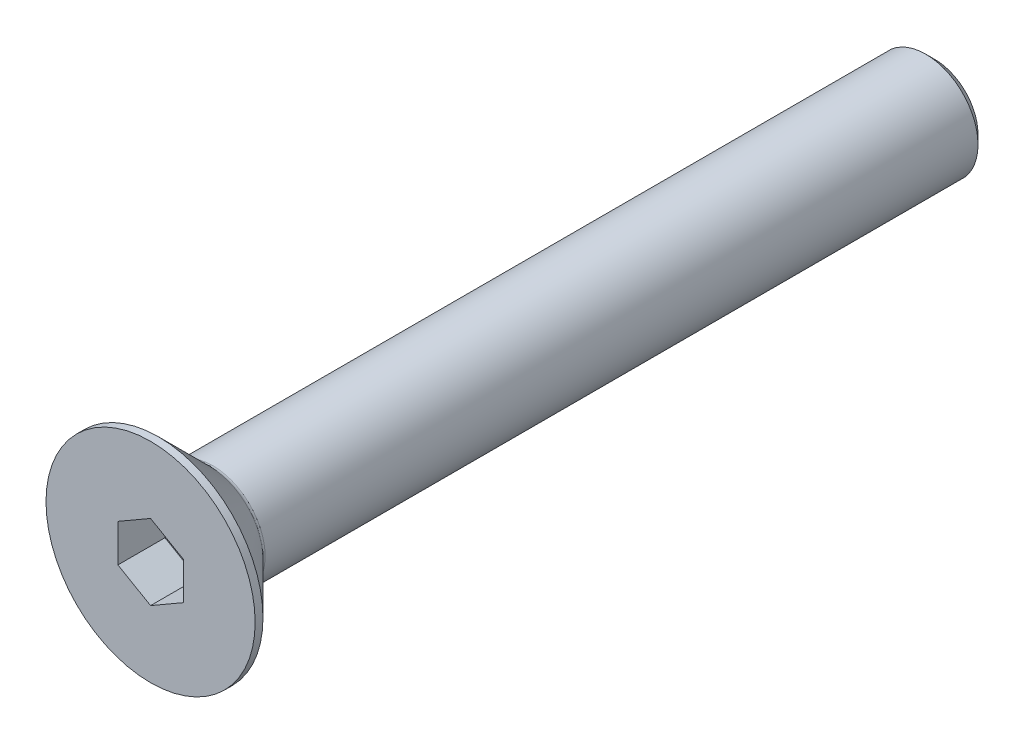
ISO-10303-21;
HEADER;
FILE_DESCRIPTION(('STEP AP214'),'2;1');
FILE_NAME('part.step','',(''),(''),'','','');
FILE_SCHEMA(('AUTOMOTIVE_DESIGN { 1 0 10303 214 1 1 1 1 }'));
ENDSEC;
DATA;
#1=APPLICATION_CONTEXT('core data for automotive mechanical design processes');
#2=APPLICATION_PROTOCOL_DEFINITION('international standard','automotive_design',2000,#1);
#3=PRODUCT_CONTEXT('',#1,'mechanical');
#4=PRODUCT('Part','Part','',(#3));
#5=PRODUCT_RELATED_PRODUCT_CATEGORY('part','',(#4));
#6=PRODUCT_DEFINITION_FORMATION('','',#4);
#7=PRODUCT_DEFINITION_CONTEXT('part definition',#1,'design');
#8=PRODUCT_DEFINITION('design','',#6,#7);
#9=PRODUCT_DEFINITION_SHAPE('','',#8);
#10=(LENGTH_UNIT() NAMED_UNIT(*) SI_UNIT(.MILLI.,.METRE.));
#11=(NAMED_UNIT(*) PLANE_ANGLE_UNIT() SI_UNIT($,.RADIAN.));
#12=(NAMED_UNIT(*) SI_UNIT($,.STERADIAN.) SOLID_ANGLE_UNIT());
#13=UNCERTAINTY_MEASURE_WITH_UNIT(LENGTH_MEASURE(1.E-05),#10,'distance_accuracy_value','');
#14=(GEOMETRIC_REPRESENTATION_CONTEXT(3) GLOBAL_UNCERTAINTY_ASSIGNED_CONTEXT((#13)) GLOBAL_UNIT_ASSIGNED_CONTEXT((#10,
#11,#12)) REPRESENTATION_CONTEXT('',''));
#15=CARTESIAN_POINT('',(0.,0.,0.));
#16=DIRECTION('',(0.,0.,1.));
#17=DIRECTION('',(1.,0.,0.));
#18=AXIS2_PLACEMENT_3D('',#15,#16,#17);
#19=CARTESIAN_POINT('',(0.,1.44337567297406,0.));
#20=DIRECTION('',(-0.5,0.866025403784439,0.));
#21=DIRECTION('',(-0.866025403784439,-0.5,0.));
#22=AXIS2_PLACEMENT_3D('',#19,#20,#21);
#23=PLANE('',#22);
#24=DIRECTION('',(0.,0.,1.));
#25=VECTOR('',#24,1.);
#26=CARTESIAN_POINT('',(0.,1.44337567297406,0.));
#27=LINE('',#26,#25);
#28=CARTESIAN_POINT('',(0.,1.44337567297406,-1.8));
#29=VERTEX_POINT('',#28);
#30=CARTESIAN_POINT('',(0.,1.44337567297406,0.));
#31=VERTEX_POINT('',#30);
#32=EDGE_CURVE('E81',#29,#31,#27,.T.);
#33=ORIENTED_EDGE('',*,*,#32,.T.);
#34=DIRECTION('',(-0.866025403784439,-0.5,0.));
#35=VECTOR('',#34,1.);
#36=CARTESIAN_POINT('',(0.,1.44337567297406,0.));
#37=LINE('',#36,#35);
#38=CARTESIAN_POINT('',(-1.25,0.721687836487033,0.));
#39=VERTEX_POINT('',#38);
#40=EDGE_CURVE('E70',#39,#31,#37,.F.);
#41=ORIENTED_EDGE('',*,*,#40,.F.);
#42=DIRECTION('',(0.,0.,1.));
#43=VECTOR('',#42,1.);
#44=CARTESIAN_POINT('',(-1.25,0.721687836487033,0.));
#45=LINE('',#44,#43);
#46=CARTESIAN_POINT('',(-1.25,0.721687836487033,-1.8));
#47=VERTEX_POINT('',#46);
#48=EDGE_CURVE('E137',#39,#47,#45,.F.);
#49=ORIENTED_EDGE('',*,*,#48,.T.);
#50=DIRECTION('',(-0.866025403784439,-0.5,0.));
#51=VECTOR('',#50,1.);
#52=CARTESIAN_POINT('',(0.,1.44337567297406,-1.8));
#53=LINE('',#52,#51);
#54=EDGE_CURVE('E66',#29,#47,#53,.T.);
#55=ORIENTED_EDGE('',*,*,#54,.F.);
#56=EDGE_LOOP('',(#33,#41,#49,#55));
#57=FACE_BOUND('',#56,.T.);
#58=ADVANCED_FACE('F15',(#57),#23,.F.);
#59=CARTESIAN_POINT('',(1.25,0.721687836487033,0.));
#60=DIRECTION('',(0.499999999999999,0.866025403784439,0.));
#61=DIRECTION('',(-0.866025403784439,0.499999999999999,0.));
#62=AXIS2_PLACEMENT_3D('',#59,#60,#61);
#63=PLANE('',#62);
#64=DIRECTION('',(0.,0.,-1.));
#65=VECTOR('',#64,1.);
#66=CARTESIAN_POINT('',(1.25,0.721687836487033,0.));
#67=LINE('',#66,#65);
#68=CARTESIAN_POINT('',(1.25,0.721687836487033,-1.8));
#69=VERTEX_POINT('',#68);
#70=CARTESIAN_POINT('',(1.25,0.721687836487033,0.));
#71=VERTEX_POINT('',#70);
#72=EDGE_CURVE('E86',#69,#71,#67,.F.);
#73=ORIENTED_EDGE('',*,*,#72,.T.);
#74=DIRECTION('',(-0.866025403784439,0.499999999999999,0.));
#75=VECTOR('',#74,1.);
#76=CARTESIAN_POINT('',(1.25,0.721687836487033,0.));
#77=LINE('',#76,#75);
#78=EDGE_CURVE('E74',#31,#71,#77,.F.);
#79=ORIENTED_EDGE('',*,*,#78,.F.);
#80=ORIENTED_EDGE('',*,*,#32,.F.);
#81=DIRECTION('',(-0.866025403784439,0.499999999999999,0.));
#82=VECTOR('',#81,1.);
#83=CARTESIAN_POINT('',(1.25,0.721687836487033,-1.8));
#84=LINE('',#83,#82);
#85=EDGE_CURVE('E87',#69,#29,#84,.T.);
#86=ORIENTED_EDGE('',*,*,#85,.F.);
#87=EDGE_LOOP('',(#73,#79,#80,#86));
#88=FACE_BOUND('',#87,.T.);
#89=ADVANCED_FACE('F84',(#88),#63,.F.);
#90=CARTESIAN_POINT('',(-1.25,0.721687836487033,0.));
#91=DIRECTION('',(-1.,0.,0.));
#92=DIRECTION('',(0.,0.,1.));
#93=AXIS2_PLACEMENT_3D('',#90,#91,#92);
#94=PLANE('',#93);
#95=ORIENTED_EDGE('',*,*,#48,.F.);
#96=DIRECTION('',(0.,1.,0.));
#97=VECTOR('',#96,1.);
#98=CARTESIAN_POINT('',(-1.25,0.721687836487033,0.));
#99=LINE('',#98,#97);
#100=CARTESIAN_POINT('',(-1.25,-0.721687836487033,0.));
#101=VERTEX_POINT('',#100);
#102=EDGE_CURVE('E77',#101,#39,#99,.T.);
#103=ORIENTED_EDGE('',*,*,#102,.F.);
#104=DIRECTION('',(0.,0.,1.));
#105=VECTOR('',#104,1.);
#106=CARTESIAN_POINT('',(-1.25,-0.721687836487033,0.));
#107=LINE('',#106,#105);
#108=CARTESIAN_POINT('',(-1.25,-0.721687836487033,-1.8));
#109=VERTEX_POINT('',#108);
#110=EDGE_CURVE('E128',#101,#109,#107,.F.);
#111=ORIENTED_EDGE('',*,*,#110,.T.);
#112=DIRECTION('',(0.,1.,0.));
#113=VECTOR('',#112,1.);
#114=CARTESIAN_POINT('',(-1.25,0.721687836487033,-1.8));
#115=LINE('',#114,#113);
#116=EDGE_CURVE('E135',#47,#109,#115,.F.);
#117=ORIENTED_EDGE('',*,*,#116,.F.);
#118=EDGE_LOOP('',(#95,#103,#111,#117));
#119=FACE_BOUND('',#118,.T.);
#120=ADVANCED_FACE('F140',(#119),#94,.F.);
#121=CARTESIAN_POINT('',(1.25,-0.721687836487033,0.));
#122=DIRECTION('',(1.,0.,0.));
#123=DIRECTION('',(0.,0.,-1.));
#124=AXIS2_PLACEMENT_3D('',#121,#122,#123);
#125=PLANE('',#124);
#126=DIRECTION('',(0.,0.,1.));
#127=VECTOR('',#126,1.);
#128=CARTESIAN_POINT('',(1.25,-0.721687836487032,0.));
#129=LINE('',#128,#127);
#130=CARTESIAN_POINT('',(1.25,-0.721687836487033,-1.8));
#131=VERTEX_POINT('',#130);
#132=CARTESIAN_POINT('',(1.25,-0.721687836487033,0.));
#133=VERTEX_POINT('',#132);
#134=EDGE_CURVE('E120',#131,#133,#129,.T.);
#135=ORIENTED_EDGE('',*,*,#134,.T.);
#136=DIRECTION('',(0.,1.,0.));
#137=VECTOR('',#136,1.);
#138=CARTESIAN_POINT('',(1.25,-0.721687836487033,0.));
#139=LINE('',#138,#137);
#140=EDGE_CURVE('E34',#71,#133,#139,.F.);
#141=ORIENTED_EDGE('',*,*,#140,.F.);
#142=ORIENTED_EDGE('',*,*,#72,.F.);
#143=DIRECTION('',(0.,1.,0.));
#144=VECTOR('',#143,1.);
#145=CARTESIAN_POINT('',(1.25,0.,-1.8));
#146=LINE('',#145,#144);
#147=EDGE_CURVE('E122',#131,#69,#146,.T.);
#148=ORIENTED_EDGE('',*,*,#147,.F.);
#149=EDGE_LOOP('',(#135,#141,#142,#148));
#150=FACE_BOUND('',#149,.T.);
#151=ADVANCED_FACE('F147',(#150),#125,.F.);
#152=CARTESIAN_POINT('',(-1.25,-0.721687836487033,0.));
#153=DIRECTION('',(-0.499999999999999,-0.866025403784439,0.));
#154=DIRECTION('',(0.866025403784439,-0.499999999999999,0.));
#155=AXIS2_PLACEMENT_3D('',#152,#153,#154);
#156=PLANE('',#155);
#157=ORIENTED_EDGE('',*,*,#110,.F.);
#158=DIRECTION('',(0.866025403784439,-0.499999999999999,0.));
#159=VECTOR('',#158,1.);
#160=CARTESIAN_POINT('',(-1.25,-0.721687836487033,0.));
#161=LINE('',#160,#159);
#162=CARTESIAN_POINT('',(0.,-1.44337567297406,0.));
#163=VERTEX_POINT('',#162);
#164=EDGE_CURVE('E131',#163,#101,#161,.F.);
#165=ORIENTED_EDGE('',*,*,#164,.F.);
#166=DIRECTION('',(0.,0.,1.));
#167=VECTOR('',#166,1.);
#168=CARTESIAN_POINT('',(0.,-1.44337567297406,0.));
#169=LINE('',#168,#167);
#170=CARTESIAN_POINT('',(0.,-1.44337567297406,-1.8));
#171=VERTEX_POINT('',#170);
#172=EDGE_CURVE('E118',#163,#171,#169,.F.);
#173=ORIENTED_EDGE('',*,*,#172,.T.);
#174=DIRECTION('',(0.866025403784439,-0.499999999999999,0.));
#175=VECTOR('',#174,1.);
#176=CARTESIAN_POINT('',(-1.25,-0.721687836487033,-1.8));
#177=LINE('',#176,#175);
#178=EDGE_CURVE('E125',#109,#171,#177,.T.);
#179=ORIENTED_EDGE('',*,*,#178,.F.);
#180=EDGE_LOOP('',(#157,#165,#173,#179));
#181=FACE_BOUND('',#180,.T.);
#182=ADVANCED_FACE('F154',(#181),#156,.F.);
#183=CARTESIAN_POINT('',(0.,0.,-1.8));
#184=DIRECTION('',(0.,0.,1.));
#185=DIRECTION('',(1.,0.,0.));
#186=AXIS2_PLACEMENT_3D('',#183,#184,#185);
#187=PLANE('',#186);
#188=ORIENTED_EDGE('',*,*,#54,.T.);
#189=ORIENTED_EDGE('',*,*,#116,.T.);
#190=ORIENTED_EDGE('',*,*,#178,.T.);
#191=DIRECTION('',(0.866025403784439,0.5,0.));
#192=VECTOR('',#191,1.);
#193=CARTESIAN_POINT('',(0.,-1.44337567297406,-1.8));
#194=LINE('',#193,#192);
#195=EDGE_CURVE('E115',#171,#131,#194,.T.);
#196=ORIENTED_EDGE('',*,*,#195,.T.);
#197=ORIENTED_EDGE('',*,*,#147,.T.);
#198=ORIENTED_EDGE('',*,*,#85,.T.);
#199=EDGE_LOOP('',(#188,#189,#190,#196,#197,#198));
#200=FACE_BOUND('',#199,.T.);
#201=ADVANCED_FACE('F144',(#200),#187,.T.);
#202=CARTESIAN_POINT('',(0.,-1.44337567297406,0.));
#203=DIRECTION('',(0.5,-0.866025403784439,0.));
#204=DIRECTION('',(0.866025403784439,0.5,0.));
#205=AXIS2_PLACEMENT_3D('',#202,#203,#204);
#206=PLANE('',#205);
#207=ORIENTED_EDGE('',*,*,#172,.F.);
#208=DIRECTION('',(-0.866025403784439,-0.499999999999999,0.));
#209=VECTOR('',#208,1.);
#210=CARTESIAN_POINT('',(1.25,-0.721687836487033,0.));
#211=LINE('',#210,#209);
#212=EDGE_CURVE('E113',#133,#163,#211,.T.);
#213=ORIENTED_EDGE('',*,*,#212,.F.);
#214=ORIENTED_EDGE('',*,*,#134,.F.);
#215=ORIENTED_EDGE('',*,*,#195,.F.);
#216=EDGE_LOOP('',(#207,#213,#214,#215));
#217=FACE_BOUND('',#216,.T.);
#218=ADVANCED_FACE('F152',(#217),#206,.F.);
#219=CARTESIAN_POINT('',(2.,0.,0.));
#220=DIRECTION('',(0.,0.,1.));
#221=DIRECTION('',(1.,0.,0.));
#222=AXIS2_PLACEMENT_3D('',#219,#220,#221);
#223=PLANE('',#222);
#224=ORIENTED_EDGE('',*,*,#140,.T.);
#225=ORIENTED_EDGE('',*,*,#212,.T.);
#226=ORIENTED_EDGE('',*,*,#164,.T.);
#227=ORIENTED_EDGE('',*,*,#102,.T.);
#228=ORIENTED_EDGE('',*,*,#40,.T.);
#229=ORIENTED_EDGE('',*,*,#78,.T.);
#230=EDGE_LOOP('',(#224,#225,#226,#227,#228,#229));
#231=FACE_BOUND('',#230,.T.);
#232=CARTESIAN_POINT('',(0.,0.,0.));
#233=DIRECTION('',(0.,0.,-1.));
#234=DIRECTION('',(-1.,0.,0.));
#235=AXIS2_PLACEMENT_3D('',#232,#233,#234);
#236=CIRCLE('',#235,4.);
#237=CARTESIAN_POINT('',(-4.,0.,0.));
#238=VERTEX_POINT('',#237);
#239=EDGE_CURVE('E19',#238,#238,#236,.T.);
#240=ORIENTED_EDGE('',*,*,#239,.F.);
#241=EDGE_LOOP('',(#240));
#242=FACE_BOUND('',#241,.T.);
#243=ADVANCED_FACE('F71',(#231,#242),#223,.T.);
#244=CARTESIAN_POINT('',(0.,0.,-0.150000000000001));
#245=DIRECTION('',(0.,0.,-1.));
#246=DIRECTION('',(-1.,0.,0.));
#247=AXIS2_PLACEMENT_3D('',#244,#245,#246);
#248=CYLINDRICAL_SURFACE('',#247,4.);
#249=ORIENTED_EDGE('',*,*,#239,.T.);
#250=EDGE_LOOP('',(#249));
#251=FACE_BOUND('',#250,.T.);
#252=CARTESIAN_POINT('',(0.,0.,-0.299999999072043));
#253=DIRECTION('',(0.,0.,1.));
#254=DIRECTION('',(1.,0.,0.));
#255=AXIS2_PLACEMENT_3D('',#252,#253,#254);
#256=CIRCLE('',#255,3.9999999991096);
#257=CARTESIAN_POINT('',(3.9999999991096,0.,-0.299999999072043));
#258=VERTEX_POINT('',#257);
#259=EDGE_CURVE('E100',#258,#258,#256,.F.);
#260=ORIENTED_EDGE('',*,*,#259,.F.);
#261=EDGE_LOOP('',(#260));
#262=FACE_BOUND('',#261,.T.);
#263=ADVANCED_FACE('F183',(#251,#262),#248,.T.);
#264=CARTESIAN_POINT('',(0.,0.,-0.299999999185729));
#265=DIRECTION('',(0.,0.,1.));
#266=DIRECTION('',(1.,0.,0.));
#267=AXIS2_PLACEMENT_3D('',#264,#265,#266);
#268=CONICAL_SURFACE('',#267,3.99999999905276,0.78539816251907);
#269=CARTESIAN_POINT('',(0.,0.,-2.24142135623731));
#270=DIRECTION('',(0.,0.,-1.));
#271=DIRECTION('',(0.,1.,0.));
#272=AXIS2_PLACEMENT_3D('',#269,#270,#271);
#273=CIRCLE('',#272,2.05857864376269);
#274=CARTESIAN_POINT('',(0.,2.05857864376269,-2.24142135623731));
#275=VERTEX_POINT('',#274);
#276=EDGE_CURVE('E94',#275,#275,#273,.T.);
#277=ORIENTED_EDGE('',*,*,#276,.F.);
#278=EDGE_LOOP('',(#277));
#279=FACE_BOUND('',#278,.T.);
#280=ORIENTED_EDGE('',*,*,#259,.T.);
#281=EDGE_LOOP('',(#280));
#282=FACE_BOUND('',#281,.T.);
#283=ADVANCED_FACE('F179',(#279,#282),#268,.T.);
#284=CARTESIAN_POINT('',(0.999999999999999,0.,-30.));
#285=DIRECTION('',(0.,0.,-1.));
#286=DIRECTION('',(-1.,0.,0.));
#287=AXIS2_PLACEMENT_3D('',#284,#285,#286);
#288=PLANE('',#287);
#289=CARTESIAN_POINT('',(0.,0.,-30.0000000001432));
#290=DIRECTION('',(0.,0.,1.));
#291=DIRECTION('',(1.,0.,0.));
#292=AXIS2_PLACEMENT_3D('',#289,#290,#291);
#293=CIRCLE('',#292,1.65000000015425);
#294=CARTESIAN_POINT('',(1.65000000015425,0.,-30.0000000001432));
#295=VERTEX_POINT('',#294);
#296=EDGE_CURVE('E92',#295,#295,#293,.T.);
#297=ORIENTED_EDGE('',*,*,#296,.F.);
#298=EDGE_LOOP('',(#297));
#299=FACE_BOUND('',#298,.T.);
#300=ADVANCED_FACE('F176',(#299),#288,.T.);
#301=CARTESIAN_POINT('',(0.,0.,-2.38284271247462));
#302=DIRECTION('',(0.,0.,-1.));
#303=DIRECTION('',(0.,1.,0.));
#304=AXIS2_PLACEMENT_3D('',#301,#302,#303);
#305=TOROIDAL_SURFACE('',#304,2.2,0.2);
#306=CARTESIAN_POINT('',(0.,0.,-2.38284271247462));
#307=DIRECTION('',(0.,0.,-1.));
#308=DIRECTION('',(-1.,0.,0.));
#309=AXIS2_PLACEMENT_3D('',#306,#307,#308);
#310=CIRCLE('',#309,2.);
#311=CARTESIAN_POINT('',(-2.,0.,-2.38284271247462));
#312=VERTEX_POINT('',#311);
#313=EDGE_CURVE('E25',#312,#312,#310,.T.);
#314=ORIENTED_EDGE('',*,*,#313,.F.);
#315=EDGE_LOOP('',(#314));
#316=FACE_BOUND('',#315,.T.);
#317=ORIENTED_EDGE('',*,*,#276,.T.);
#318=EDGE_LOOP('',(#317));
#319=FACE_BOUND('',#318,.T.);
#320=ADVANCED_FACE('F17',(#316,#319),#305,.F.);
#321=CARTESIAN_POINT('',(0.,0.,-29.6499999998332));
#322=DIRECTION('',(0.,0.,1.));
#323=DIRECTION('',(1.,0.,0.));
#324=AXIS2_PLACEMENT_3D('',#321,#322,#323);
#325=CONICAL_SURFACE('',#324,1.99999999983902,0.785398162504195);
#326=ORIENTED_EDGE('',*,*,#296,.T.);
#327=EDGE_LOOP('',(#326));
#328=FACE_BOUND('',#327,.T.);
#329=CARTESIAN_POINT('',(0.,0.,-29.65));
#330=DIRECTION('',(0.,0.,-1.));
#331=DIRECTION('',(-1.,0.,0.));
#332=AXIS2_PLACEMENT_3D('',#329,#330,#331);
#333=CIRCLE('',#332,2.);
#334=CARTESIAN_POINT('',(-2.,0.,-29.65));
#335=VERTEX_POINT('',#334);
#336=EDGE_CURVE('E10',#335,#335,#333,.F.);
#337=ORIENTED_EDGE('',*,*,#336,.F.);
#338=EDGE_LOOP('',(#337));
#339=FACE_BOUND('',#338,.T.);
#340=ADVANCED_FACE('F166',(#328,#339),#325,.T.);
#341=CARTESIAN_POINT('',(0.,0.,-16.15));
#342=DIRECTION('',(0.,0.,-1.));
#343=DIRECTION('',(-1.,0.,0.));
#344=AXIS2_PLACEMENT_3D('',#341,#342,#343);
#345=CYLINDRICAL_SURFACE('',#344,2.);
#346=ORIENTED_EDGE('',*,*,#336,.T.);
#347=EDGE_LOOP('',(#346));
#348=FACE_BOUND('',#347,.T.);
#349=ORIENTED_EDGE('',*,*,#313,.T.);
#350=EDGE_LOOP('',(#349));
#351=FACE_BOUND('',#350,.T.);
#352=ADVANCED_FACE('F164',(#348,#351),#345,.T.);
#353=CLOSED_SHELL('',(#58,#89,#120,#151,#182,#201,#218,#243,#263,#283,#300,#320,#340,#352));
#354=MANIFOLD_SOLID_BREP('B1',#353);
#355=ADVANCED_BREP_SHAPE_REPRESENTATION('',(#18,#354),#14);
#356=SHAPE_DEFINITION_REPRESENTATION(#9,#355);
ENDSEC;
END-ISO-10303-21;
